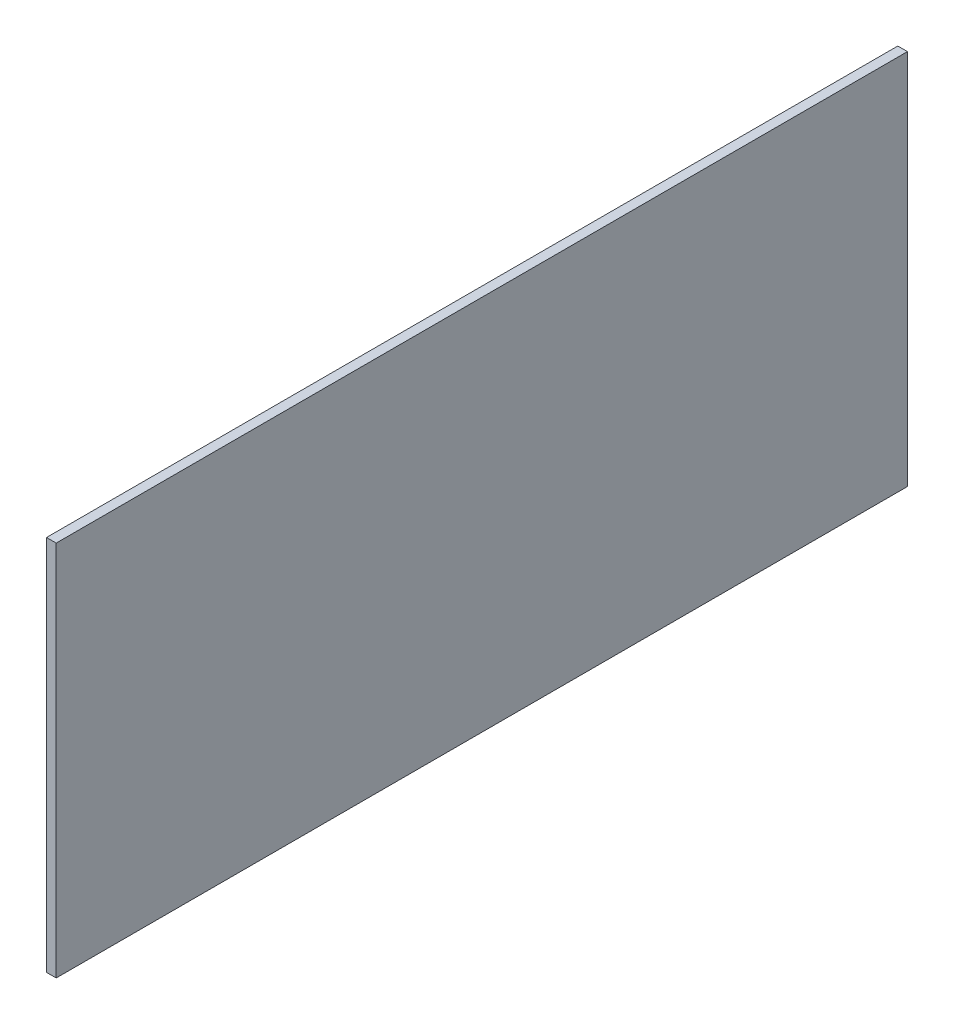
ISO-10303-21;
HEADER;
FILE_DESCRIPTION(('STEP AP214'),'2;1');
FILE_NAME('part.step','',(''),(''),'','','');
FILE_SCHEMA(('AUTOMOTIVE_DESIGN { 1 0 10303 214 1 1 1 1 }'));
ENDSEC;
DATA;
#1=APPLICATION_CONTEXT('core data for automotive mechanical design processes');
#2=APPLICATION_PROTOCOL_DEFINITION('international standard','automotive_design',2000,#1);
#3=PRODUCT_CONTEXT('',#1,'mechanical');
#4=PRODUCT('Part','Part','',(#3));
#5=PRODUCT_RELATED_PRODUCT_CATEGORY('part','',(#4));
#6=PRODUCT_DEFINITION_FORMATION('','',#4);
#7=PRODUCT_DEFINITION_CONTEXT('part definition',#1,'design');
#8=PRODUCT_DEFINITION('design','',#6,#7);
#9=PRODUCT_DEFINITION_SHAPE('','',#8);
#10=(LENGTH_UNIT() NAMED_UNIT(*) SI_UNIT(.MILLI.,.METRE.));
#11=(NAMED_UNIT(*) PLANE_ANGLE_UNIT() SI_UNIT($,.RADIAN.));
#12=(NAMED_UNIT(*) SI_UNIT($,.STERADIAN.) SOLID_ANGLE_UNIT());
#13=UNCERTAINTY_MEASURE_WITH_UNIT(LENGTH_MEASURE(1.E-05),#10,'distance_accuracy_value','');
#14=(GEOMETRIC_REPRESENTATION_CONTEXT(3) GLOBAL_UNCERTAINTY_ASSIGNED_CONTEXT((#13)) GLOBAL_UNIT_ASSIGNED_CONTEXT((#10,
#11,#12)) REPRESENTATION_CONTEXT('',''));
#15=CARTESIAN_POINT('',(0.,0.,0.));
#16=DIRECTION('',(0.,0.,1.));
#17=DIRECTION('',(1.,0.,0.));
#18=AXIS2_PLACEMENT_3D('',#15,#16,#17);
#19=CARTESIAN_POINT('',(18.,409.349151892094,270.108471071373));
#20=DIRECTION('',(0.,-1.,0.));
#21=DIRECTION('',(0.,0.,-1.));
#22=AXIS2_PLACEMENT_3D('',#19,#20,#21);
#23=PLANE('',#22);
#24=DIRECTION('',(0.,0.,1.));
#25=VECTOR('',#24,1.);
#26=CARTESIAN_POINT('',(0.,409.349151892094,270.108471071373));
#27=LINE('',#26,#25);
#28=CARTESIAN_POINT('',(0.,409.349151892094,-1311.89152892863));
#29=VERTEX_POINT('',#28);
#30=CARTESIAN_POINT('',(0.,409.349151892094,270.108471071373));
#31=VERTEX_POINT('',#30);
#32=EDGE_CURVE('E98',#29,#31,#27,.T.);
#33=ORIENTED_EDGE('',*,*,#32,.T.);
#34=DIRECTION('',(-1.,0.,0.));
#35=VECTOR('',#34,1.);
#36=CARTESIAN_POINT('',(18.,409.349151892094,270.108471071373));
#37=LINE('',#36,#35);
#38=CARTESIAN_POINT('',(18.,409.349151892094,270.108471071373));
#39=VERTEX_POINT('',#38);
#40=EDGE_CURVE('E11',#39,#31,#37,.T.);
#41=ORIENTED_EDGE('',*,*,#40,.F.);
#42=DIRECTION('',(0.,0.,1.));
#43=VECTOR('',#42,1.);
#44=CARTESIAN_POINT('',(18.,409.349151892094,270.108471071373));
#45=LINE('',#44,#43);
#46=CARTESIAN_POINT('',(18.,409.349151892094,-1311.89152892863));
#47=VERTEX_POINT('',#46);
#48=EDGE_CURVE('E86',#47,#39,#45,.T.);
#49=ORIENTED_EDGE('',*,*,#48,.F.);
#50=DIRECTION('',(-1.,0.,0.));
#51=VECTOR('',#50,1.);
#52=CARTESIAN_POINT('',(18.,409.349151892094,-1311.89152892863));
#53=LINE('',#52,#51);
#54=EDGE_CURVE('E94',#47,#29,#53,.T.);
#55=ORIENTED_EDGE('',*,*,#54,.T.);
#56=EDGE_LOOP('',(#33,#41,#49,#55));
#57=FACE_BOUND('',#56,.T.);
#58=ADVANCED_FACE('F35',(#57),#23,.F.);
#59=CARTESIAN_POINT('',(18.,-290.650848107906,270.108471071373));
#60=DIRECTION('',(0.,0.,-1.));
#61=DIRECTION('',(-1.,0.,0.));
#62=AXIS2_PLACEMENT_3D('',#59,#60,#61);
#63=PLANE('',#62);
#64=DIRECTION('',(0.,-1.,0.));
#65=VECTOR('',#64,1.);
#66=CARTESIAN_POINT('',(0.,-290.650848107906,270.108471071373));
#67=LINE('',#66,#65);
#68=CARTESIAN_POINT('',(0.,-290.650848107906,270.108471071373));
#69=VERTEX_POINT('',#68);
#70=EDGE_CURVE('E90',#31,#69,#67,.T.);
#71=ORIENTED_EDGE('',*,*,#70,.T.);
#72=DIRECTION('',(-1.,0.,0.));
#73=VECTOR('',#72,1.);
#74=CARTESIAN_POINT('',(18.,-290.650848107906,270.108471071373));
#75=LINE('',#74,#73);
#76=CARTESIAN_POINT('',(18.,-290.650848107906,270.108471071373));
#77=VERTEX_POINT('',#76);
#78=EDGE_CURVE('E43',#77,#69,#75,.T.);
#79=ORIENTED_EDGE('',*,*,#78,.F.);
#80=DIRECTION('',(0.,-1.,0.));
#81=VECTOR('',#80,1.);
#82=CARTESIAN_POINT('',(18.,-290.650848107906,270.108471071373));
#83=LINE('',#82,#81);
#84=EDGE_CURVE('E81',#39,#77,#83,.T.);
#85=ORIENTED_EDGE('',*,*,#84,.F.);
#86=ORIENTED_EDGE('',*,*,#40,.T.);
#87=EDGE_LOOP('',(#71,#79,#85,#86));
#88=FACE_BOUND('',#87,.T.);
#89=ADVANCED_FACE('F89',(#88),#63,.F.);
#90=CARTESIAN_POINT('',(18.,-290.650848107906,-1311.89152892863));
#91=DIRECTION('',(0.,1.,0.));
#92=DIRECTION('',(0.,0.,1.));
#93=AXIS2_PLACEMENT_3D('',#90,#91,#92);
#94=PLANE('',#93);
#95=DIRECTION('',(0.,0.,-1.));
#96=VECTOR('',#95,1.);
#97=CARTESIAN_POINT('',(0.,-290.650848107906,-1311.89152892863));
#98=LINE('',#97,#96);
#99=CARTESIAN_POINT('',(0.,-290.650848107906,-1311.89152892863));
#100=VERTEX_POINT('',#99);
#101=EDGE_CURVE('E68',#69,#100,#98,.T.);
#102=ORIENTED_EDGE('',*,*,#101,.T.);
#103=DIRECTION('',(-1.,0.,0.));
#104=VECTOR('',#103,1.);
#105=CARTESIAN_POINT('',(18.,-290.650848107906,-1311.89152892863));
#106=LINE('',#105,#104);
#107=CARTESIAN_POINT('',(18.,-290.650848107906,-1311.89152892863));
#108=VERTEX_POINT('',#107);
#109=EDGE_CURVE('E91',#108,#100,#106,.T.);
#110=ORIENTED_EDGE('',*,*,#109,.F.);
#111=DIRECTION('',(0.,0.,-1.));
#112=VECTOR('',#111,1.);
#113=CARTESIAN_POINT('',(18.,-290.650848107906,-1311.89152892863));
#114=LINE('',#113,#112);
#115=EDGE_CURVE('E84',#77,#108,#114,.T.);
#116=ORIENTED_EDGE('',*,*,#115,.F.);
#117=ORIENTED_EDGE('',*,*,#78,.T.);
#118=EDGE_LOOP('',(#102,#110,#116,#117));
#119=FACE_BOUND('',#118,.T.);
#120=ADVANCED_FACE('F92',(#119),#94,.F.);
#121=CARTESIAN_POINT('',(18.,409.349151892094,-1311.89152892863));
#122=DIRECTION('',(0.,0.,1.));
#123=DIRECTION('',(1.,0.,0.));
#124=AXIS2_PLACEMENT_3D('',#121,#122,#123);
#125=PLANE('',#124);
#126=DIRECTION('',(0.,1.,0.));
#127=VECTOR('',#126,1.);
#128=CARTESIAN_POINT('',(0.,409.349151892094,-1311.89152892863));
#129=LINE('',#128,#127);
#130=EDGE_CURVE('E74',#100,#29,#129,.T.);
#131=ORIENTED_EDGE('',*,*,#130,.T.);
#132=ORIENTED_EDGE('',*,*,#54,.F.);
#133=DIRECTION('',(0.,1.,0.));
#134=VECTOR('',#133,1.);
#135=CARTESIAN_POINT('',(18.,409.349151892094,-1311.89152892863));
#136=LINE('',#135,#134);
#137=EDGE_CURVE('E51',#108,#47,#136,.T.);
#138=ORIENTED_EDGE('',*,*,#137,.F.);
#139=ORIENTED_EDGE('',*,*,#109,.T.);
#140=EDGE_LOOP('',(#131,#132,#138,#139));
#141=FACE_BOUND('',#140,.T.);
#142=ADVANCED_FACE('F105',(#141),#125,.F.);
#143=CARTESIAN_POINT('',(18.,0.,0.));
#144=DIRECTION('',(-1.,0.,0.));
#145=DIRECTION('',(0.,0.,1.));
#146=AXIS2_PLACEMENT_3D('',#143,#144,#145);
#147=PLANE('',#146);
#148=ORIENTED_EDGE('',*,*,#48,.T.);
#149=ORIENTED_EDGE('',*,*,#84,.T.);
#150=ORIENTED_EDGE('',*,*,#115,.T.);
#151=ORIENTED_EDGE('',*,*,#137,.T.);
#152=EDGE_LOOP('',(#148,#149,#150,#151));
#153=FACE_BOUND('',#152,.T.);
#154=ADVANCED_FACE('F82',(#153),#147,.F.);
#155=CARTESIAN_POINT('',(0.,0.,0.));
#156=DIRECTION('',(-1.,0.,0.));
#157=DIRECTION('',(0.,0.,1.));
#158=AXIS2_PLACEMENT_3D('',#155,#156,#157);
#159=PLANE('',#158);
#160=ORIENTED_EDGE('',*,*,#32,.F.);
#161=ORIENTED_EDGE('',*,*,#130,.F.);
#162=ORIENTED_EDGE('',*,*,#101,.F.);
#163=ORIENTED_EDGE('',*,*,#70,.F.);
#164=EDGE_LOOP('',(#160,#161,#162,#163));
#165=FACE_BOUND('',#164,.T.);
#166=ADVANCED_FACE('F108',(#165),#159,.T.);
#167=CLOSED_SHELL('',(#58,#89,#120,#142,#154,#166));
#168=MANIFOLD_SOLID_BREP('B2',#167);
#169=ADVANCED_BREP_SHAPE_REPRESENTATION('',(#18,#168),#14);
#170=SHAPE_DEFINITION_REPRESENTATION(#9,#169);
ENDSEC;
END-ISO-10303-21;
